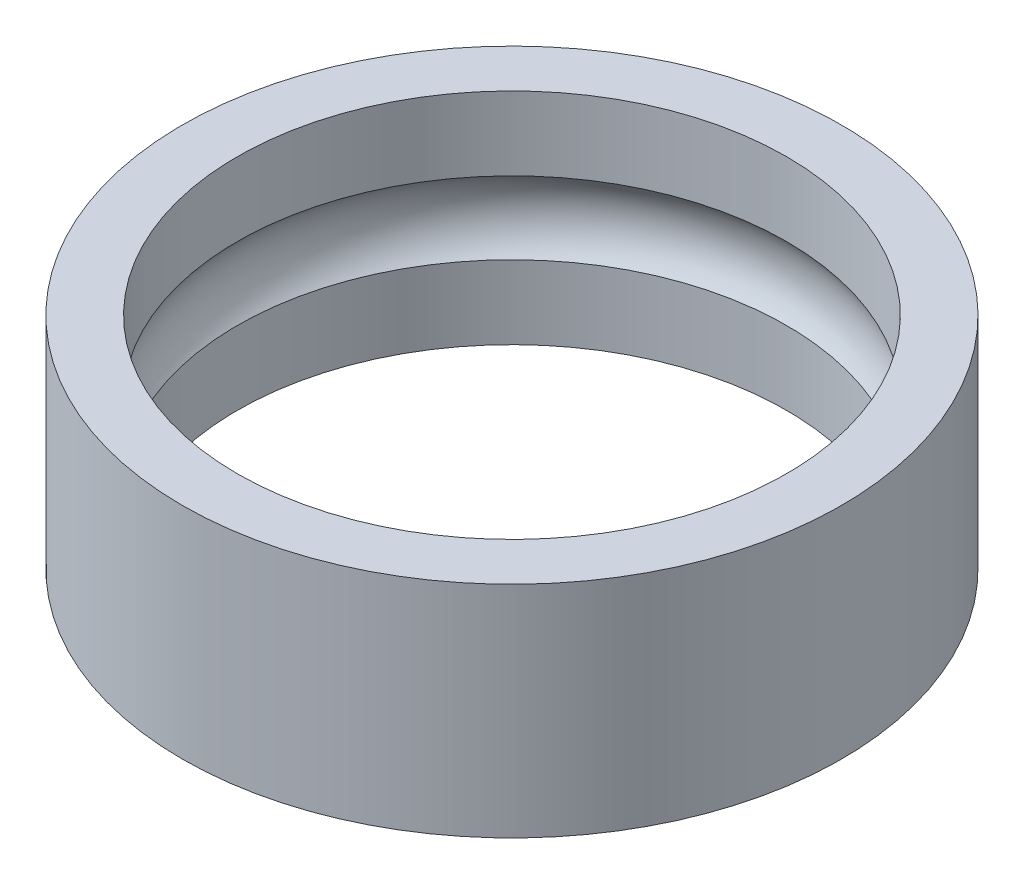
ISO-10303-21;
HEADER;
FILE_DESCRIPTION(('STEP AP214'),'2;1');
FILE_NAME('part.step','',(''),(''),'','','');
FILE_SCHEMA(('AUTOMOTIVE_DESIGN { 1 0 10303 214 1 1 1 1 }'));
ENDSEC;
DATA;
#1=APPLICATION_CONTEXT('core data for automotive mechanical design processes');
#2=APPLICATION_PROTOCOL_DEFINITION('international standard','automotive_design',2000,#1);
#3=PRODUCT_CONTEXT('',#1,'mechanical');
#4=PRODUCT('Part','Part','',(#3));
#5=PRODUCT_RELATED_PRODUCT_CATEGORY('part','',(#4));
#6=PRODUCT_DEFINITION_FORMATION('','',#4);
#7=PRODUCT_DEFINITION_CONTEXT('part definition',#1,'design');
#8=PRODUCT_DEFINITION('design','',#6,#7);
#9=PRODUCT_DEFINITION_SHAPE('','',#8);
#10=(LENGTH_UNIT() NAMED_UNIT(*) SI_UNIT(.MILLI.,.METRE.));
#11=(NAMED_UNIT(*) PLANE_ANGLE_UNIT() SI_UNIT($,.RADIAN.));
#12=(NAMED_UNIT(*) SI_UNIT($,.STERADIAN.) SOLID_ANGLE_UNIT());
#13=UNCERTAINTY_MEASURE_WITH_UNIT(LENGTH_MEASURE(1.E-05),#10,'distance_accuracy_value','');
#14=(GEOMETRIC_REPRESENTATION_CONTEXT(3) GLOBAL_UNCERTAINTY_ASSIGNED_CONTEXT((#13)) GLOBAL_UNIT_ASSIGNED_CONTEXT((#10,
#11,#12)) REPRESENTATION_CONTEXT('',''));
#15=CARTESIAN_POINT('',(0.,0.,0.));
#16=DIRECTION('',(0.,0.,1.));
#17=DIRECTION('',(1.,0.,0.));
#18=AXIS2_PLACEMENT_3D('',#15,#16,#17);
#19=CARTESIAN_POINT('',(0.,1.,0.));
#20=DIRECTION('',(0.,-1.,0.));
#21=DIRECTION('',(0.,0.,-1.));
#22=AXIS2_PLACEMENT_3D('',#19,#20,#21);
#23=CYLINDRICAL_SURFACE('',#22,2.5);
#24=CARTESIAN_POINT('',(0.,1.,0.));
#25=DIRECTION('',(0.,1.,0.));
#26=DIRECTION('',(0.,0.,1.));
#27=AXIS2_PLACEMENT_3D('',#24,#25,#26);
#28=CIRCLE('',#27,2.5);
#29=CARTESIAN_POINT('',(0.,1.,2.5));
#30=VERTEX_POINT('',#29);
#31=EDGE_CURVE('E43',#30,#30,#28,.T.);
#32=ORIENTED_EDGE('',*,*,#31,.T.);
#33=EDGE_LOOP('',(#32));
#34=FACE_BOUND('',#33,.T.);
#35=CARTESIAN_POINT('',(0.,0.330718913883074,0.));
#36=DIRECTION('',(0.,-1.,0.));
#37=DIRECTION('',(0.,0.,-1.));
#38=AXIS2_PLACEMENT_3D('',#35,#36,#37);
#39=CIRCLE('',#38,2.5);
#40=CARTESIAN_POINT('',(0.,0.330718913883074,-2.5));
#41=VERTEX_POINT('',#40);
#42=EDGE_CURVE('E34',#41,#41,#39,.T.);
#43=ORIENTED_EDGE('',*,*,#42,.T.);
#44=EDGE_LOOP('',(#43));
#45=FACE_BOUND('',#44,.T.);
#46=ADVANCED_FACE('F30',(#34,#45),#23,.F.);
#47=CARTESIAN_POINT('',(0.,-1.,0.));
#48=DIRECTION('',(0.,1.,0.));
#49=DIRECTION('',(0.,0.,1.));
#50=AXIS2_PLACEMENT_3D('',#47,#48,#49);
#51=CIRCLE('',#50,2.5);
#52=CARTESIAN_POINT('',(0.,-1.,2.5));
#53=VERTEX_POINT('',#52);
#54=EDGE_CURVE('E46',#53,#53,#51,.T.);
#55=ORIENTED_EDGE('',*,*,#54,.F.);
#56=EDGE_LOOP('',(#55));
#57=FACE_BOUND('',#56,.T.);
#58=CARTESIAN_POINT('',(0.,-0.330718913883074,0.));
#59=DIRECTION('',(0.,1.,0.));
#60=DIRECTION('',(0.,0.,1.));
#61=AXIS2_PLACEMENT_3D('',#58,#59,#60);
#62=CIRCLE('',#61,2.5);
#63=CARTESIAN_POINT('',(0.,-0.330718913883074,2.5));
#64=VERTEX_POINT('',#63);
#65=EDGE_CURVE('E48',#64,#64,#62,.T.);
#66=ORIENTED_EDGE('',*,*,#65,.T.);
#67=EDGE_LOOP('',(#66));
#68=FACE_BOUND('',#67,.T.);
#69=ADVANCED_FACE('F65',(#57,#68),#23,.F.);
#70=CARTESIAN_POINT('',(0.,1.,0.));
#71=DIRECTION('',(0.,1.,0.));
#72=DIRECTION('',(0.,0.,1.));
#73=AXIS2_PLACEMENT_3D('',#70,#71,#72);
#74=PLANE('',#73);
#75=CARTESIAN_POINT('',(0.,1.,0.));
#76=DIRECTION('',(0.,1.,0.));
#77=DIRECTION('',(0.,0.,1.));
#78=AXIS2_PLACEMENT_3D('',#75,#76,#77);
#79=CIRCLE('',#78,3.);
#80=CARTESIAN_POINT('',(0.,1.,3.));
#81=VERTEX_POINT('',#80);
#82=EDGE_CURVE('E10',#81,#81,#79,.T.);
#83=ORIENTED_EDGE('',*,*,#82,.T.);
#84=EDGE_LOOP('',(#83));
#85=FACE_BOUND('',#84,.T.);
#86=ORIENTED_EDGE('',*,*,#31,.F.);
#87=EDGE_LOOP('',(#86));
#88=FACE_BOUND('',#87,.T.);
#89=ADVANCED_FACE('F62',(#85,#88),#74,.T.);
#90=CARTESIAN_POINT('',(0.,-1.,0.));
#91=DIRECTION('',(0.,1.,0.));
#92=DIRECTION('',(0.,0.,1.));
#93=AXIS2_PLACEMENT_3D('',#90,#91,#92);
#94=PLANE('',#93);
#95=CARTESIAN_POINT('',(0.,-1.,0.));
#96=DIRECTION('',(0.,1.,0.));
#97=DIRECTION('',(0.,0.,1.));
#98=AXIS2_PLACEMENT_3D('',#95,#96,#97);
#99=CIRCLE('',#98,3.);
#100=CARTESIAN_POINT('',(0.,-1.,3.));
#101=VERTEX_POINT('',#100);
#102=EDGE_CURVE('E38',#101,#101,#99,.T.);
#103=ORIENTED_EDGE('',*,*,#102,.F.);
#104=EDGE_LOOP('',(#103));
#105=FACE_BOUND('',#104,.T.);
#106=ORIENTED_EDGE('',*,*,#54,.T.);
#107=EDGE_LOOP('',(#106));
#108=FACE_BOUND('',#107,.T.);
#109=ADVANCED_FACE('F64',(#105,#108),#94,.F.);
#110=CARTESIAN_POINT('',(0.,1.,0.));
#111=DIRECTION('',(0.,-1.,0.));
#112=DIRECTION('',(0.,0.,-1.));
#113=AXIS2_PLACEMENT_3D('',#110,#111,#112);
#114=CYLINDRICAL_SURFACE('',#113,3.);
#115=ORIENTED_EDGE('',*,*,#82,.F.);
#116=EDGE_LOOP('',(#115));
#117=FACE_BOUND('',#116,.T.);
#118=ORIENTED_EDGE('',*,*,#102,.T.);
#119=EDGE_LOOP('',(#118));
#120=FACE_BOUND('',#119,.T.);
#121=ADVANCED_FACE('F32',(#117,#120),#114,.T.);
#122=CARTESIAN_POINT('',(0.,0.,0.));
#123=DIRECTION('',(0.,1.,0.));
#124=DIRECTION('',(0.,0.,1.));
#125=AXIS2_PLACEMENT_3D('',#122,#123,#124);
#126=TOROIDAL_SURFACE('',#125,2.125,0.5);
#127=ORIENTED_EDGE('',*,*,#42,.F.);
#128=EDGE_LOOP('',(#127));
#129=FACE_BOUND('',#128,.T.);
#130=ORIENTED_EDGE('',*,*,#65,.F.);
#131=EDGE_LOOP('',(#130));
#132=FACE_BOUND('',#131,.T.);
#133=ADVANCED_FACE('F78',(#129,#132),#126,.F.);
#134=CLOSED_SHELL('',(#46,#69,#89,#109,#121,#133));
#135=MANIFOLD_SOLID_BREP('B2',#134);
#136=ADVANCED_BREP_SHAPE_REPRESENTATION('',(#18,#135),#14);
#137=SHAPE_DEFINITION_REPRESENTATION(#9,#136);
ENDSEC;
END-ISO-10303-21;
